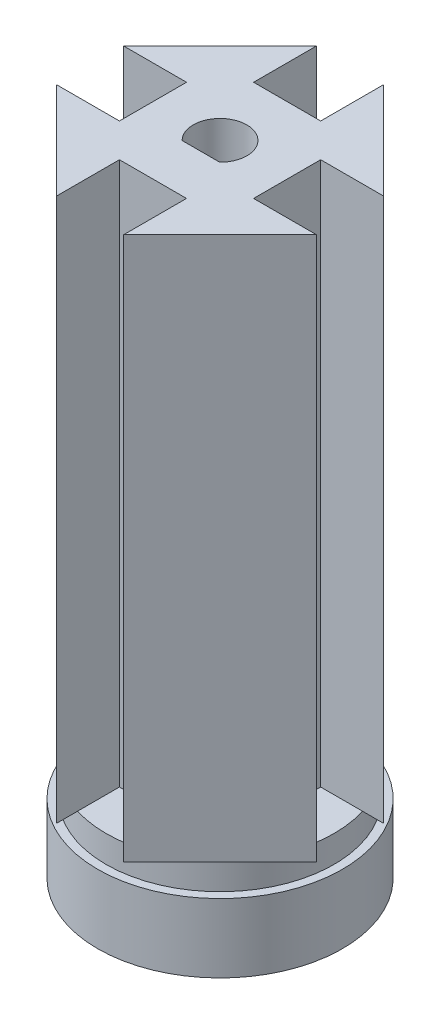
ISO-10303-21;
HEADER;
FILE_DESCRIPTION(('STEP AP214'),'2;1');
FILE_NAME('part.step','',(''),(''),'','','');
FILE_SCHEMA(('AUTOMOTIVE_DESIGN { 1 0 10303 214 1 1 1 1 }'));
ENDSEC;
DATA;
#1=APPLICATION_CONTEXT('core data for automotive mechanical design processes');
#2=APPLICATION_PROTOCOL_DEFINITION('international standard','automotive_design',2000,#1);
#3=PRODUCT_CONTEXT('',#1,'mechanical');
#4=PRODUCT('Part','Part','',(#3));
#5=PRODUCT_RELATED_PRODUCT_CATEGORY('part','',(#4));
#6=PRODUCT_DEFINITION_FORMATION('','',#4);
#7=PRODUCT_DEFINITION_CONTEXT('part definition',#1,'design');
#8=PRODUCT_DEFINITION('design','',#6,#7);
#9=PRODUCT_DEFINITION_SHAPE('','',#8);
#10=(LENGTH_UNIT() NAMED_UNIT(*) SI_UNIT(.MILLI.,.METRE.));
#11=(NAMED_UNIT(*) PLANE_ANGLE_UNIT() SI_UNIT($,.RADIAN.));
#12=(NAMED_UNIT(*) SI_UNIT($,.STERADIAN.) SOLID_ANGLE_UNIT());
#13=UNCERTAINTY_MEASURE_WITH_UNIT(LENGTH_MEASURE(1.E-05),#10,'distance_accuracy_value','');
#14=(GEOMETRIC_REPRESENTATION_CONTEXT(3) GLOBAL_UNCERTAINTY_ASSIGNED_CONTEXT((#13)) GLOBAL_UNIT_ASSIGNED_CONTEXT((#10,
#11,#12)) REPRESENTATION_CONTEXT('',''));
#15=CARTESIAN_POINT('',(0.,0.,0.));
#16=DIRECTION('',(0.,0.,1.));
#17=DIRECTION('',(1.,0.,0.));
#18=AXIS2_PLACEMENT_3D('',#15,#16,#17);
#19=CARTESIAN_POINT('',(0.,4.25499999999989,0.));
#20=DIRECTION('',(0.,1.,0.));
#21=DIRECTION('',(0.,0.,1.));
#22=AXIS2_PLACEMENT_3D('',#19,#20,#21);
#23=PLANE('',#22);
#24=DIRECTION('',(-0.707106781186548,0.,0.707106781186548));
#25=VECTOR('',#24,1.);
#26=CARTESIAN_POINT('',(-12.1824583655185,4.25499999999984,-12.1824583655185));
#27=LINE('',#26,#25);
#28=CARTESIAN_POINT('',(-4.99999999999999,4.25499999999984,-19.3649167310371));
#29=VERTEX_POINT('',#28);
#30=CARTESIAN_POINT('',(-19.3649167310371,4.25499999999988,-5.));
#31=VERTEX_POINT('',#30);
#32=EDGE_CURVE('E398',#29,#31,#27,.T.);
#33=ORIENTED_EDGE('',*,*,#32,.F.);
#34=DIRECTION('',(0.,0.,1.));
#35=VECTOR('',#34,1.);
#36=CARTESIAN_POINT('',(-5.,4.25499999999988,0.));
#37=LINE('',#36,#35);
#38=CARTESIAN_POINT('',(-5.,4.25499999999988,-16.2480768092719));
#39=VERTEX_POINT('',#38);
#40=EDGE_CURVE('E345',#29,#39,#37,.T.);
#41=ORIENTED_EDGE('',*,*,#40,.T.);
#42=CARTESIAN_POINT('',(0.,4.25499999999989,0.));
#43=DIRECTION('',(0.,1.,0.));
#44=DIRECTION('',(0.,0.,1.));
#45=AXIS2_PLACEMENT_3D('',#42,#43,#44);
#46=CIRCLE('',#45,17.);
#47=CARTESIAN_POINT('',(-16.2480768092719,4.25499999999989,-5.));
#48=VERTEX_POINT('',#47);
#49=EDGE_CURVE('E242',#48,#39,#46,.F.);
#50=ORIENTED_EDGE('',*,*,#49,.F.);
#51=DIRECTION('',(-1.,0.,0.));
#52=VECTOR('',#51,1.);
#53=CARTESIAN_POINT('',(0.,4.25499999999988,-5.));
#54=LINE('',#53,#52);
#55=EDGE_CURVE('E316',#48,#31,#54,.T.);
#56=ORIENTED_EDGE('',*,*,#55,.T.);
#57=EDGE_LOOP('',(#33,#41,#50,#56));
#58=FACE_BOUND('',#57,.T.);
#59=ADVANCED_FACE('F51',(#58),#23,.F.);
#60=CARTESIAN_POINT('',(0.,85.2549999999999,0.));
#61=DIRECTION('',(0.,1.,0.));
#62=DIRECTION('',(0.,0.,1.));
#63=AXIS2_PLACEMENT_3D('',#60,#61,#62);
#64=PLANE('',#63);
#65=DIRECTION('',(-0.707106781186548,0.,-0.707106781186548));
#66=VECTOR('',#65,1.);
#67=CARTESIAN_POINT('',(-12.1824583655185,85.2549999999999,12.1824583655185));
#68=LINE('',#67,#66);
#69=CARTESIAN_POINT('',(-5.,85.2549999999999,19.3649167310371));
#70=VERTEX_POINT('',#69);
#71=CARTESIAN_POINT('',(-19.3649167310371,85.2549999999999,5.));
#72=VERTEX_POINT('',#71);
#73=EDGE_CURVE('E448',#70,#72,#68,.T.);
#74=ORIENTED_EDGE('',*,*,#73,.F.);
#75=DIRECTION('',(0.,0.,1.));
#76=VECTOR('',#75,1.);
#77=CARTESIAN_POINT('',(-5.,85.2549999999999,0.));
#78=LINE('',#77,#76);
#79=CARTESIAN_POINT('',(-5.,85.2549999999999,10.));
#80=VERTEX_POINT('',#79);
#81=EDGE_CURVE('E273',#80,#70,#78,.T.);
#82=ORIENTED_EDGE('',*,*,#81,.F.);
#83=DIRECTION('',(1.,0.,0.));
#84=VECTOR('',#83,1.);
#85=CARTESIAN_POINT('',(0.,85.2549999999999,10.));
#86=LINE('',#85,#84);
#87=CARTESIAN_POINT('',(5.,85.2549999999999,10.));
#88=VERTEX_POINT('',#87);
#89=EDGE_CURVE('E279',#80,#88,#86,.T.);
#90=ORIENTED_EDGE('',*,*,#89,.T.);
#91=DIRECTION('',(0.,0.,1.));
#92=VECTOR('',#91,1.);
#93=CARTESIAN_POINT('',(5.,85.2549999999999,0.));
#94=LINE('',#93,#92);
#95=CARTESIAN_POINT('',(5.,85.2549999999999,19.3649167310371));
#96=VERTEX_POINT('',#95);
#97=EDGE_CURVE('E292',#88,#96,#94,.T.);
#98=ORIENTED_EDGE('',*,*,#97,.T.);
#99=DIRECTION('',(-0.707106781186548,0.,0.707106781186548));
#100=VECTOR('',#99,1.);
#101=CARTESIAN_POINT('',(12.1824583655185,85.2549999999999,12.1824583655185));
#102=LINE('',#101,#100);
#103=CARTESIAN_POINT('',(19.3649167310371,85.2549999999999,5.));
#104=VERTEX_POINT('',#103);
#105=EDGE_CURVE('E429',#104,#96,#102,.T.);
#106=ORIENTED_EDGE('',*,*,#105,.F.);
#107=DIRECTION('',(1.,0.,0.));
#108=VECTOR('',#107,1.);
#109=CARTESIAN_POINT('',(0.,85.2549999999999,5.));
#110=LINE('',#109,#108);
#111=CARTESIAN_POINT('',(9.99999673103709,85.2549999999999,5.));
#112=VERTEX_POINT('',#111);
#113=EDGE_CURVE('E402',#112,#104,#110,.T.);
#114=ORIENTED_EDGE('',*,*,#113,.F.);
#115=DIRECTION('',(0.,0.,-1.));
#116=VECTOR('',#115,1.);
#117=CARTESIAN_POINT('',(9.99999673103709,85.2549999999999,0.));
#118=LINE('',#117,#116);
#119=CARTESIAN_POINT('',(9.99999673103709,85.2549999999999,-5.));
#120=VERTEX_POINT('',#119);
#121=EDGE_CURVE('E397',#112,#120,#118,.T.);
#122=ORIENTED_EDGE('',*,*,#121,.T.);
#123=DIRECTION('',(1.,0.,0.));
#124=VECTOR('',#123,1.);
#125=CARTESIAN_POINT('',(0.,85.2549999999999,-5.));
#126=LINE('',#125,#124);
#127=CARTESIAN_POINT('',(19.3649167310371,85.2549999999999,-5.));
#128=VERTEX_POINT('',#127);
#129=EDGE_CURVE('E393',#120,#128,#126,.T.);
#130=ORIENTED_EDGE('',*,*,#129,.T.);
#131=DIRECTION('',(0.707106781186548,0.,0.707106781186548));
#132=VECTOR('',#131,1.);
#133=CARTESIAN_POINT('',(12.1824583655185,85.2549999999999,-12.1824583655185));
#134=LINE('',#133,#132);
#135=CARTESIAN_POINT('',(5.,85.2549999999999,-19.3649167310371));
#136=VERTEX_POINT('',#135);
#137=EDGE_CURVE('E435',#136,#128,#134,.T.);
#138=ORIENTED_EDGE('',*,*,#137,.F.);
#139=DIRECTION('',(0.,0.,1.));
#140=VECTOR('',#139,1.);
#141=CARTESIAN_POINT('',(5.,85.2549999999999,0.));
#142=LINE('',#141,#140);
#143=CARTESIAN_POINT('',(5.,85.2549999999999,-10.));
#144=VERTEX_POINT('',#143);
#145=EDGE_CURVE('E368',#136,#144,#142,.T.);
#146=ORIENTED_EDGE('',*,*,#145,.T.);
#147=DIRECTION('',(1.,0.,0.));
#148=VECTOR('',#147,1.);
#149=CARTESIAN_POINT('',(0.,85.2549999999999,-10.));
#150=LINE('',#149,#148);
#151=CARTESIAN_POINT('',(-5.,85.2549999999999,-10.));
#152=VERTEX_POINT('',#151);
#153=EDGE_CURVE('E363',#152,#144,#150,.T.);
#154=ORIENTED_EDGE('',*,*,#153,.F.);
#155=DIRECTION('',(0.,0.,1.));
#156=VECTOR('',#155,1.);
#157=CARTESIAN_POINT('',(-5.,85.2549999999999,0.));
#158=LINE('',#157,#156);
#159=CARTESIAN_POINT('',(-4.99999999999999,85.2549999999999,-19.3649167310371));
#160=VERTEX_POINT('',#159);
#161=EDGE_CURVE('E359',#160,#152,#158,.T.);
#162=ORIENTED_EDGE('',*,*,#161,.F.);
#163=DIRECTION('',(-0.707106781186548,0.,0.707106781186548));
#164=VECTOR('',#163,1.);
#165=CARTESIAN_POINT('',(-12.1824583655185,85.2549999999999,-12.1824583655185));
#166=LINE('',#165,#164);
#167=CARTESIAN_POINT('',(-19.3649167310371,85.2549999999999,-5.));
#168=VERTEX_POINT('',#167);
#169=EDGE_CURVE('E283',#160,#168,#166,.T.);
#170=ORIENTED_EDGE('',*,*,#169,.T.);
#171=DIRECTION('',(-1.,0.,0.));
#172=VECTOR('',#171,1.);
#173=CARTESIAN_POINT('',(0.,85.2549999999999,-5.));
#174=LINE('',#173,#172);
#175=CARTESIAN_POINT('',(-10.,85.2549999999999,-5.));
#176=VERTEX_POINT('',#175);
#177=EDGE_CURVE('E330',#176,#168,#174,.T.);
#178=ORIENTED_EDGE('',*,*,#177,.F.);
#179=DIRECTION('',(0.,0.,-1.));
#180=VECTOR('',#179,1.);
#181=CARTESIAN_POINT('',(-10.,85.2549999999999,0.));
#182=LINE('',#181,#180);
#183=CARTESIAN_POINT('',(-10.,85.2549999999999,5.));
#184=VERTEX_POINT('',#183);
#185=EDGE_CURVE('E325',#184,#176,#182,.T.);
#186=ORIENTED_EDGE('',*,*,#185,.F.);
#187=DIRECTION('',(-1.,0.,0.));
#188=VECTOR('',#187,1.);
#189=CARTESIAN_POINT('',(0.,85.2549999999999,5.));
#190=LINE('',#189,#188);
#191=EDGE_CURVE('E321',#184,#72,#190,.T.);
#192=ORIENTED_EDGE('',*,*,#191,.T.);
#193=EDGE_LOOP('',(#74,#82,#90,#98,#106,#114,#122,#130,#138,#146,#154,#162,#170,#178,#186,#192));
#194=FACE_BOUND('',#193,.T.);
#195=CARTESIAN_POINT('',(0.,85.2549999999999,0.));
#196=DIRECTION('',(0.,1.,0.));
#197=DIRECTION('',(0.,0.,1.));
#198=AXIS2_PLACEMENT_3D('',#195,#196,#197);
#199=CIRCLE('',#198,4.);
#200=CARTESIAN_POINT('',(2.80668844013724,85.2549999999999,2.85));
#201=VERTEX_POINT('',#200);
#202=CARTESIAN_POINT('',(-2.80668844013724,85.2549999999999,2.85));
#203=VERTEX_POINT('',#202);
#204=EDGE_CURVE('E216',#201,#203,#199,.T.);
#205=ORIENTED_EDGE('',*,*,#204,.F.);
#206=DIRECTION('',(1.,0.,0.));
#207=VECTOR('',#206,1.);
#208=CARTESIAN_POINT('',(0.,85.2549999999999,2.85));
#209=LINE('',#208,#207);
#210=EDGE_CURVE('E205',#203,#201,#209,.T.);
#211=ORIENTED_EDGE('',*,*,#210,.F.);
#212=EDGE_LOOP('',(#205,#211));
#213=FACE_BOUND('',#212,.T.);
#214=ADVANCED_FACE('F215',(#194,#213),#64,.T.);
#215=DIRECTION('',(1.,0.,0.));
#216=VECTOR('',#215,1.);
#217=CARTESIAN_POINT('',(0.,4.25499999999988,5.));
#218=LINE('',#217,#216);
#219=CARTESIAN_POINT('',(16.2480768092719,4.25499999999989,5.));
#220=VERTEX_POINT('',#219);
#221=CARTESIAN_POINT('',(19.3649167310371,4.25499999999984,5.));
#222=VERTEX_POINT('',#221);
#223=EDGE_CURVE('E265',#220,#222,#218,.T.);
#224=ORIENTED_EDGE('',*,*,#223,.T.);
#225=DIRECTION('',(-0.707106781186548,0.,0.707106781186548));
#226=VECTOR('',#225,1.);
#227=CARTESIAN_POINT('',(12.1824583655185,4.25499999999984,12.1824583655185));
#228=LINE('',#227,#226);
#229=CARTESIAN_POINT('',(5.,4.25499999999984,19.3649167310371));
#230=VERTEX_POINT('',#229);
#231=EDGE_CURVE('E268',#222,#230,#228,.T.);
#232=ORIENTED_EDGE('',*,*,#231,.T.);
#233=DIRECTION('',(0.,0.,1.));
#234=VECTOR('',#233,1.);
#235=CARTESIAN_POINT('',(5.,4.25499999999988,0.));
#236=LINE('',#235,#234);
#237=CARTESIAN_POINT('',(5.,4.25499999999988,16.2480768092719));
#238=VERTEX_POINT('',#237);
#239=EDGE_CURVE('E267',#238,#230,#236,.T.);
#240=ORIENTED_EDGE('',*,*,#239,.F.);
#241=EDGE_CURVE('E226',#220,#238,#46,.F.);
#242=ORIENTED_EDGE('',*,*,#241,.F.);
#243=EDGE_LOOP('',(#224,#232,#240,#242));
#244=FACE_BOUND('',#243,.T.);
#245=ADVANCED_FACE('F263',(#244),#23,.F.);
#246=DIRECTION('',(0.,0.,1.));
#247=VECTOR('',#246,1.);
#248=CARTESIAN_POINT('',(-5.,4.25499999999988,0.));
#249=LINE('',#248,#247);
#250=CARTESIAN_POINT('',(-5.,4.25499999999989,16.2480768092719));
#251=VERTEX_POINT('',#250);
#252=CARTESIAN_POINT('',(-5.,4.25499999999988,19.3649167310371));
#253=VERTEX_POINT('',#252);
#254=EDGE_CURVE('E287',#251,#253,#249,.T.);
#255=ORIENTED_EDGE('',*,*,#254,.T.);
#256=DIRECTION('',(-0.707106781186548,0.,-0.707106781186548));
#257=VECTOR('',#256,1.);
#258=CARTESIAN_POINT('',(-12.1824583655185,4.25499999999984,12.1824583655185));
#259=LINE('',#258,#257);
#260=CARTESIAN_POINT('',(-19.3649167310371,4.25499999999984,5.));
#261=VERTEX_POINT('',#260);
#262=EDGE_CURVE('E441',#253,#261,#259,.T.);
#263=ORIENTED_EDGE('',*,*,#262,.T.);
#264=DIRECTION('',(-1.,0.,0.));
#265=VECTOR('',#264,1.);
#266=CARTESIAN_POINT('',(0.,4.25499999999988,5.));
#267=LINE('',#266,#265);
#268=CARTESIAN_POINT('',(-16.2480768092719,4.25499999999988,5.));
#269=VERTEX_POINT('',#268);
#270=EDGE_CURVE('E312',#269,#261,#267,.T.);
#271=ORIENTED_EDGE('',*,*,#270,.F.);
#272=EDGE_CURVE('E55',#251,#269,#46,.F.);
#273=ORIENTED_EDGE('',*,*,#272,.F.);
#274=EDGE_LOOP('',(#255,#263,#271,#273));
#275=FACE_BOUND('',#274,.T.);
#276=ADVANCED_FACE('F488',(#275),#23,.F.);
#277=DIRECTION('',(0.,0.,1.));
#278=VECTOR('',#277,1.);
#279=CARTESIAN_POINT('',(5.,4.25499999999988,0.));
#280=LINE('',#279,#278);
#281=CARTESIAN_POINT('',(5.,4.25499999999988,-19.3649167310371));
#282=VERTEX_POINT('',#281);
#283=CARTESIAN_POINT('',(5.,4.25499999999989,-16.2480768092719));
#284=VERTEX_POINT('',#283);
#285=EDGE_CURVE('E355',#282,#284,#280,.T.);
#286=ORIENTED_EDGE('',*,*,#285,.F.);
#287=DIRECTION('',(0.707106781186548,0.,0.707106781186548));
#288=VECTOR('',#287,1.);
#289=CARTESIAN_POINT('',(12.1824583655185,4.25499999999984,-12.1824583655185));
#290=LINE('',#289,#288);
#291=CARTESIAN_POINT('',(19.3649167310371,4.25499999999984,-5.));
#292=VERTEX_POINT('',#291);
#293=EDGE_CURVE('E439',#282,#292,#290,.T.);
#294=ORIENTED_EDGE('',*,*,#293,.T.);
#295=DIRECTION('',(1.,0.,0.));
#296=VECTOR('',#295,1.);
#297=CARTESIAN_POINT('',(0.,4.25499999999988,-5.));
#298=LINE('',#297,#296);
#299=CARTESIAN_POINT('',(16.2480768092719,4.25499999999988,-5.));
#300=VERTEX_POINT('',#299);
#301=EDGE_CURVE('E388',#300,#292,#298,.T.);
#302=ORIENTED_EDGE('',*,*,#301,.F.);
#303=EDGE_CURVE('E249',#284,#300,#46,.F.);
#304=ORIENTED_EDGE('',*,*,#303,.F.);
#305=EDGE_LOOP('',(#286,#294,#302,#304));
#306=FACE_BOUND('',#305,.T.);
#307=ADVANCED_FACE('F467',(#306),#23,.F.);
#308=CARTESIAN_POINT('',(0.,5.25499999999989,0.));
#309=DIRECTION('',(0.,-1.,0.));
#310=DIRECTION('',(0.,0.,-1.));
#311=AXIS2_PLACEMENT_3D('',#308,#309,#310);
#312=CYLINDRICAL_SURFACE('',#311,4.);
#313=DIRECTION('',(0.,-1.,0.));
#314=VECTOR('',#313,1.);
#315=CARTESIAN_POINT('',(2.80668844013724,85.2549999999999,2.85));
#316=LINE('',#315,#314);
#317=CARTESIAN_POINT('',(2.80668844013724,0.254999999999901,2.85));
#318=VERTEX_POINT('',#317);
#319=EDGE_CURVE('E211',#201,#318,#316,.T.);
#320=ORIENTED_EDGE('',*,*,#319,.F.);
#321=ORIENTED_EDGE('',*,*,#204,.T.);
#322=DIRECTION('',(0.,-1.,0.));
#323=VECTOR('',#322,1.);
#324=CARTESIAN_POINT('',(-2.80668844013724,85.2549999999999,2.85));
#325=LINE('',#324,#323);
#326=CARTESIAN_POINT('',(-2.80668844013724,0.254999999999901,2.85));
#327=VERTEX_POINT('',#326);
#328=EDGE_CURVE('E202',#203,#327,#325,.T.);
#329=ORIENTED_EDGE('',*,*,#328,.T.);
#330=CARTESIAN_POINT('',(0.,0.254999999999901,0.));
#331=DIRECTION('',(0.,1.,0.));
#332=DIRECTION('',(0.,0.,1.));
#333=AXIS2_PLACEMENT_3D('',#330,#331,#332);
#334=CIRCLE('',#333,4.);
#335=EDGE_CURVE('E61',#318,#327,#334,.T.);
#336=ORIENTED_EDGE('',*,*,#335,.F.);
#337=EDGE_LOOP('',(#320,#321,#329,#336));
#338=FACE_BOUND('',#337,.T.);
#339=ADVANCED_FACE('F53',(#338),#312,.F.);
#340=CARTESIAN_POINT('',(0.,5.25499999999989,0.));
#341=DIRECTION('',(0.,-1.,0.));
#342=DIRECTION('',(0.,0.,-1.));
#343=AXIS2_PLACEMENT_3D('',#340,#341,#342);
#344=CYLINDRICAL_SURFACE('',#343,17.);
#345=CARTESIAN_POINT('',(0.,0.254999999999901,0.));
#346=DIRECTION('',(0.,1.,0.));
#347=DIRECTION('',(0.,0.,1.));
#348=AXIS2_PLACEMENT_3D('',#345,#346,#347);
#349=CIRCLE('',#348,17.);
#350=CARTESIAN_POINT('',(0.,0.254999999999901,17.));
#351=VERTEX_POINT('',#350);
#352=EDGE_CURVE('E12',#351,#351,#349,.F.);
#353=ORIENTED_EDGE('',*,*,#352,.F.);
#354=EDGE_LOOP('',(#353));
#355=FACE_BOUND('',#354,.T.);
#356=ORIENTED_EDGE('',*,*,#272,.T.);
#357=EDGE_CURVE('E237',#269,#48,#46,.F.);
#358=ORIENTED_EDGE('',*,*,#357,.T.);
#359=ORIENTED_EDGE('',*,*,#49,.T.);
#360=EDGE_CURVE('E245',#39,#284,#46,.F.);
#361=ORIENTED_EDGE('',*,*,#360,.T.);
#362=ORIENTED_EDGE('',*,*,#303,.T.);
#363=EDGE_CURVE('E252',#300,#220,#46,.F.);
#364=ORIENTED_EDGE('',*,*,#363,.T.);
#365=ORIENTED_EDGE('',*,*,#241,.T.);
#366=EDGE_CURVE('E220',#238,#251,#46,.F.);
#367=ORIENTED_EDGE('',*,*,#366,.T.);
#368=EDGE_LOOP('',(#356,#358,#359,#361,#362,#364,#365,#367));
#369=FACE_BOUND('',#368,.T.);
#370=ADVANCED_FACE('F259',(#355,#369),#344,.T.);
#371=CARTESIAN_POINT('',(0.,0.254999999999901,0.));
#372=DIRECTION('',(0.,1.,0.));
#373=DIRECTION('',(0.,0.,1.));
#374=AXIS2_PLACEMENT_3D('',#371,#372,#373);
#375=PLANE('',#374);
#376=ORIENTED_EDGE('',*,*,#335,.T.);
#377=DIRECTION('',(1.,0.,0.));
#378=VECTOR('',#377,1.);
#379=CARTESIAN_POINT('',(0.,0.254999999999901,2.85));
#380=LINE('',#379,#378);
#381=EDGE_CURVE('E67',#327,#318,#380,.T.);
#382=ORIENTED_EDGE('',*,*,#381,.T.);
#383=EDGE_LOOP('',(#376,#382));
#384=FACE_BOUND('',#383,.T.);
#385=ORIENTED_EDGE('',*,*,#352,.T.);
#386=EDGE_LOOP('',(#385));
#387=FACE_BOUND('',#386,.T.);
#388=ADVANCED_FACE('F506',(#384,#387),#375,.F.);
#389=CARTESIAN_POINT('',(0.,4.25499999999988,-5.));
#390=DIRECTION('',(0.,0.,1.));
#391=DIRECTION('',(1.,0.,0.));
#392=AXIS2_PLACEMENT_3D('',#389,#390,#391);
#393=PLANE('',#392);
#394=ORIENTED_EDGE('',*,*,#129,.F.);
#395=DIRECTION('',(0.,1.,0.));
#396=VECTOR('',#395,1.);
#397=CARTESIAN_POINT('',(9.99999673103709,4.25499999999988,-5.));
#398=LINE('',#397,#396);
#399=CARTESIAN_POINT('',(9.99999673103709,4.25499999999988,-5.));
#400=VERTEX_POINT('',#399);
#401=EDGE_CURVE('E232',#400,#120,#398,.T.);
#402=ORIENTED_EDGE('',*,*,#401,.F.);
#403=EDGE_CURVE('E383',#400,#300,#298,.T.);
#404=ORIENTED_EDGE('',*,*,#403,.T.);
#405=ORIENTED_EDGE('',*,*,#301,.T.);
#406=DIRECTION('',(0.,1.,0.));
#407=VECTOR('',#406,1.);
#408=CARTESIAN_POINT('',(19.3649167310371,4.25499999999988,-5.));
#409=LINE('',#408,#407);
#410=EDGE_CURVE('E364',#292,#128,#409,.T.);
#411=ORIENTED_EDGE('',*,*,#410,.T.);
#412=EDGE_LOOP('',(#394,#402,#404,#405,#411));
#413=FACE_BOUND('',#412,.T.);
#414=ADVANCED_FACE('F423',(#413),#393,.T.);
#415=CARTESIAN_POINT('',(0.,4.25499999999988,5.));
#416=DIRECTION('',(0.,0.,1.));
#417=DIRECTION('',(1.,0.,0.));
#418=AXIS2_PLACEMENT_3D('',#415,#416,#417);
#419=PLANE('',#418);
#420=ORIENTED_EDGE('',*,*,#113,.T.);
#421=DIRECTION('',(0.,1.,0.));
#422=VECTOR('',#421,1.);
#423=CARTESIAN_POINT('',(19.3649167310371,4.25499999999988,5.));
#424=LINE('',#423,#422);
#425=EDGE_CURVE('E409',#222,#104,#424,.T.);
#426=ORIENTED_EDGE('',*,*,#425,.F.);
#427=ORIENTED_EDGE('',*,*,#223,.F.);
#428=CARTESIAN_POINT('',(9.99999673103709,4.25499999999988,5.));
#429=VERTEX_POINT('',#428);
#430=EDGE_CURVE('E75',#429,#220,#218,.T.);
#431=ORIENTED_EDGE('',*,*,#430,.F.);
#432=DIRECTION('',(0.,1.,0.));
#433=VECTOR('',#432,1.);
#434=CARTESIAN_POINT('',(9.99999673103709,4.25499999999988,5.));
#435=LINE('',#434,#433);
#436=EDGE_CURVE('E411',#429,#112,#435,.T.);
#437=ORIENTED_EDGE('',*,*,#436,.T.);
#438=EDGE_LOOP('',(#420,#426,#427,#431,#437));
#439=FACE_BOUND('',#438,.T.);
#440=ADVANCED_FACE('F431',(#439),#419,.F.);
#441=CARTESIAN_POINT('',(9.99999673103709,4.25499999999988,0.));
#442=DIRECTION('',(1.,0.,0.));
#443=DIRECTION('',(0.,0.,-1.));
#444=AXIS2_PLACEMENT_3D('',#441,#442,#443);
#445=PLANE('',#444);
#446=ORIENTED_EDGE('',*,*,#121,.F.);
#447=ORIENTED_EDGE('',*,*,#436,.F.);
#448=DIRECTION('',(0.,0.,-1.));
#449=VECTOR('',#448,1.);
#450=CARTESIAN_POINT('',(9.99999673103709,4.25499999999988,0.));
#451=LINE('',#450,#449);
#452=EDGE_CURVE('E387',#429,#400,#451,.T.);
#453=ORIENTED_EDGE('',*,*,#452,.T.);
#454=ORIENTED_EDGE('',*,*,#401,.T.);
#455=EDGE_LOOP('',(#446,#447,#453,#454));
#456=FACE_BOUND('',#455,.T.);
#457=ADVANCED_FACE('F419',(#456),#445,.T.);
#458=CARTESIAN_POINT('',(0.,4.25499999999988,0.));
#459=DIRECTION('',(0.,1.,0.));
#460=DIRECTION('',(0.,0.,1.));
#461=AXIS2_PLACEMENT_3D('',#458,#459,#460);
#462=PLANE('',#461);
#463=ORIENTED_EDGE('',*,*,#403,.F.);
#464=ORIENTED_EDGE('',*,*,#452,.F.);
#465=ORIENTED_EDGE('',*,*,#430,.T.);
#466=ORIENTED_EDGE('',*,*,#363,.F.);
#467=EDGE_LOOP('',(#463,#464,#465,#466));
#468=FACE_BOUND('',#467,.T.);
#469=ADVANCED_FACE('F472',(#468),#462,.T.);
#470=CARTESIAN_POINT('',(-5.,4.25499999999988,0.));
#471=DIRECTION('',(-1.,0.,0.));
#472=DIRECTION('',(0.,0.,1.));
#473=AXIS2_PLACEMENT_3D('',#470,#471,#472);
#474=PLANE('',#473);
#475=ORIENTED_EDGE('',*,*,#161,.T.);
#476=DIRECTION('',(0.,1.,0.));
#477=VECTOR('',#476,1.);
#478=CARTESIAN_POINT('',(-5.,4.25499999999988,-10.));
#479=LINE('',#478,#477);
#480=CARTESIAN_POINT('',(-5.,4.25499999999988,-10.));
#481=VERTEX_POINT('',#480);
#482=EDGE_CURVE('E358',#481,#152,#479,.T.);
#483=ORIENTED_EDGE('',*,*,#482,.F.);
#484=EDGE_CURVE('E350',#39,#481,#37,.T.);
#485=ORIENTED_EDGE('',*,*,#484,.F.);
#486=ORIENTED_EDGE('',*,*,#40,.F.);
#487=DIRECTION('',(0.,1.,0.));
#488=VECTOR('',#487,1.);
#489=CARTESIAN_POINT('',(-5.,4.25499999999988,-19.3649167310371));
#490=LINE('',#489,#488);
#491=EDGE_CURVE('E326',#29,#160,#490,.T.);
#492=ORIENTED_EDGE('',*,*,#491,.T.);
#493=EDGE_LOOP('',(#475,#483,#485,#486,#492));
#494=FACE_BOUND('',#493,.T.);
#495=ADVANCED_FACE('F474',(#494),#474,.F.);
#496=CARTESIAN_POINT('',(5.,4.25499999999988,0.));
#497=DIRECTION('',(-1.,0.,0.));
#498=DIRECTION('',(0.,0.,1.));
#499=AXIS2_PLACEMENT_3D('',#496,#497,#498);
#500=PLANE('',#499);
#501=ORIENTED_EDGE('',*,*,#145,.F.);
#502=DIRECTION('',(0.,1.,0.));
#503=VECTOR('',#502,1.);
#504=CARTESIAN_POINT('',(5.,4.25499999999988,-19.3649167310371));
#505=LINE('',#504,#503);
#506=EDGE_CURVE('E375',#282,#136,#505,.T.);
#507=ORIENTED_EDGE('',*,*,#506,.F.);
#508=ORIENTED_EDGE('',*,*,#285,.T.);
#509=CARTESIAN_POINT('',(5.,4.25499999999988,-10.));
#510=VERTEX_POINT('',#509);
#511=EDGE_CURVE('E354',#284,#510,#280,.T.);
#512=ORIENTED_EDGE('',*,*,#511,.T.);
#513=DIRECTION('',(0.,1.,0.));
#514=VECTOR('',#513,1.);
#515=CARTESIAN_POINT('',(5.,4.25499999999988,-10.));
#516=LINE('',#515,#514);
#517=EDGE_CURVE('E378',#510,#144,#516,.T.);
#518=ORIENTED_EDGE('',*,*,#517,.T.);
#519=EDGE_LOOP('',(#501,#507,#508,#512,#518));
#520=FACE_BOUND('',#519,.T.);
#521=ADVANCED_FACE('F480',(#520),#500,.T.);
#522=CARTESIAN_POINT('',(0.,4.25499999999988,-10.));
#523=DIRECTION('',(0.,0.,1.));
#524=DIRECTION('',(1.,0.,0.));
#525=AXIS2_PLACEMENT_3D('',#522,#523,#524);
#526=PLANE('',#525);
#527=ORIENTED_EDGE('',*,*,#153,.T.);
#528=ORIENTED_EDGE('',*,*,#517,.F.);
#529=DIRECTION('',(1.,0.,0.));
#530=VECTOR('',#529,1.);
#531=CARTESIAN_POINT('',(0.,4.25499999999988,-10.));
#532=LINE('',#531,#530);
#533=EDGE_CURVE('E349',#481,#510,#532,.T.);
#534=ORIENTED_EDGE('',*,*,#533,.F.);
#535=ORIENTED_EDGE('',*,*,#482,.T.);
#536=EDGE_LOOP('',(#527,#528,#534,#535));
#537=FACE_BOUND('',#536,.T.);
#538=ADVANCED_FACE('F539',(#537),#526,.F.);
#539=CARTESIAN_POINT('',(0.,4.25499999999988,0.));
#540=DIRECTION('',(0.,1.,0.));
#541=DIRECTION('',(0.,0.,1.));
#542=AXIS2_PLACEMENT_3D('',#539,#540,#541);
#543=PLANE('',#542);
#544=ORIENTED_EDGE('',*,*,#484,.T.);
#545=ORIENTED_EDGE('',*,*,#533,.T.);
#546=ORIENTED_EDGE('',*,*,#511,.F.);
#547=ORIENTED_EDGE('',*,*,#360,.F.);
#548=EDGE_LOOP('',(#544,#545,#546,#547));
#549=FACE_BOUND('',#548,.T.);
#550=ADVANCED_FACE('F544',(#549),#543,.T.);
#551=CARTESIAN_POINT('',(0.,4.25499999999988,5.));
#552=DIRECTION('',(0.,0.,-1.));
#553=DIRECTION('',(-1.,0.,0.));
#554=AXIS2_PLACEMENT_3D('',#551,#552,#553);
#555=PLANE('',#554);
#556=ORIENTED_EDGE('',*,*,#191,.F.);
#557=DIRECTION('',(0.,1.,0.));
#558=VECTOR('',#557,1.);
#559=CARTESIAN_POINT('',(-10.,4.25499999999988,5.));
#560=LINE('',#559,#558);
#561=CARTESIAN_POINT('',(-10.,4.25499999999988,5.));
#562=VERTEX_POINT('',#561);
#563=EDGE_CURVE('E320',#562,#184,#560,.T.);
#564=ORIENTED_EDGE('',*,*,#563,.F.);
#565=EDGE_CURVE('E307',#562,#269,#267,.T.);
#566=ORIENTED_EDGE('',*,*,#565,.T.);
#567=ORIENTED_EDGE('',*,*,#270,.T.);
#568=DIRECTION('',(0.,1.,0.));
#569=VECTOR('',#568,1.);
#570=CARTESIAN_POINT('',(-19.3649167310371,4.25499999999988,5.));
#571=LINE('',#570,#569);
#572=EDGE_CURVE('E296',#261,#72,#571,.T.);
#573=ORIENTED_EDGE('',*,*,#572,.T.);
#574=EDGE_LOOP('',(#556,#564,#566,#567,#573));
#575=FACE_BOUND('',#574,.T.);
#576=ADVANCED_FACE('F556',(#575),#555,.T.);
#577=CARTESIAN_POINT('',(0.,4.25499999999988,-5.));
#578=DIRECTION('',(0.,0.,-1.));
#579=DIRECTION('',(-1.,0.,0.));
#580=AXIS2_PLACEMENT_3D('',#577,#578,#579);
#581=PLANE('',#580);
#582=ORIENTED_EDGE('',*,*,#177,.T.);
#583=DIRECTION('',(0.,1.,0.));
#584=VECTOR('',#583,1.);
#585=CARTESIAN_POINT('',(-19.3649167310371,4.25499999999988,-5.));
#586=LINE('',#585,#584);
#587=EDGE_CURVE('E337',#31,#168,#586,.T.);
#588=ORIENTED_EDGE('',*,*,#587,.F.);
#589=ORIENTED_EDGE('',*,*,#55,.F.);
#590=CARTESIAN_POINT('',(-10.,4.25499999999988,-5.));
#591=VERTEX_POINT('',#590);
#592=EDGE_CURVE('E317',#591,#48,#54,.T.);
#593=ORIENTED_EDGE('',*,*,#592,.F.);
#594=DIRECTION('',(0.,1.,0.));
#595=VECTOR('',#594,1.);
#596=CARTESIAN_POINT('',(-10.,4.25499999999988,-5.));
#597=LINE('',#596,#595);
#598=EDGE_CURVE('E340',#591,#176,#597,.T.);
#599=ORIENTED_EDGE('',*,*,#598,.T.);
#600=EDGE_LOOP('',(#582,#588,#589,#593,#599));
#601=FACE_BOUND('',#600,.T.);
#602=ADVANCED_FACE('F570',(#601),#581,.F.);
#603=CARTESIAN_POINT('',(-10.,4.25499999999988,0.));
#604=DIRECTION('',(1.,0.,0.));
#605=DIRECTION('',(0.,0.,-1.));
#606=AXIS2_PLACEMENT_3D('',#603,#604,#605);
#607=PLANE('',#606);
#608=ORIENTED_EDGE('',*,*,#185,.T.);
#609=ORIENTED_EDGE('',*,*,#598,.F.);
#610=DIRECTION('',(0.,0.,-1.));
#611=VECTOR('',#610,1.);
#612=CARTESIAN_POINT('',(-10.,4.25499999999988,0.));
#613=LINE('',#612,#611);
#614=EDGE_CURVE('E311',#562,#591,#613,.T.);
#615=ORIENTED_EDGE('',*,*,#614,.F.);
#616=ORIENTED_EDGE('',*,*,#563,.T.);
#617=EDGE_LOOP('',(#608,#609,#615,#616));
#618=FACE_BOUND('',#617,.T.);
#619=ADVANCED_FACE('F564',(#618),#607,.F.);
#620=CARTESIAN_POINT('',(0.,4.25499999999988,0.));
#621=DIRECTION('',(0.,1.,0.));
#622=DIRECTION('',(0.,0.,1.));
#623=AXIS2_PLACEMENT_3D('',#620,#621,#622);
#624=PLANE('',#623);
#625=ORIENTED_EDGE('',*,*,#565,.F.);
#626=ORIENTED_EDGE('',*,*,#614,.T.);
#627=ORIENTED_EDGE('',*,*,#592,.T.);
#628=ORIENTED_EDGE('',*,*,#357,.F.);
#629=EDGE_LOOP('',(#625,#626,#627,#628));
#630=FACE_BOUND('',#629,.T.);
#631=ADVANCED_FACE('F569',(#630),#624,.T.);
#632=CARTESIAN_POINT('',(5.,4.25499999999988,0.));
#633=DIRECTION('',(-1.,0.,0.));
#634=DIRECTION('',(0.,0.,1.));
#635=AXIS2_PLACEMENT_3D('',#632,#633,#634);
#636=PLANE('',#635);
#637=ORIENTED_EDGE('',*,*,#97,.F.);
#638=DIRECTION('',(0.,1.,0.));
#639=VECTOR('',#638,1.);
#640=CARTESIAN_POINT('',(5.,4.25499999999988,10.));
#641=LINE('',#640,#639);
#642=CARTESIAN_POINT('',(5.,4.25499999999988,10.));
#643=VERTEX_POINT('',#642);
#644=EDGE_CURVE('E291',#643,#88,#641,.T.);
#645=ORIENTED_EDGE('',*,*,#644,.F.);
#646=EDGE_CURVE('E272',#643,#238,#236,.T.);
#647=ORIENTED_EDGE('',*,*,#646,.T.);
#648=ORIENTED_EDGE('',*,*,#239,.T.);
#649=DIRECTION('',(0.,1.,0.));
#650=VECTOR('',#649,1.);
#651=CARTESIAN_POINT('',(5.,4.25499999999988,19.3649167310371));
#652=LINE('',#651,#650);
#653=EDGE_CURVE('E221',#230,#96,#652,.T.);
#654=ORIENTED_EDGE('',*,*,#653,.T.);
#655=EDGE_LOOP('',(#637,#645,#647,#648,#654));
#656=FACE_BOUND('',#655,.T.);
#657=ADVANCED_FACE('F582',(#656),#636,.T.);
#658=CARTESIAN_POINT('',(-5.,4.25499999999988,0.));
#659=DIRECTION('',(-1.,0.,0.));
#660=DIRECTION('',(0.,0.,1.));
#661=AXIS2_PLACEMENT_3D('',#658,#659,#660);
#662=PLANE('',#661);
#663=ORIENTED_EDGE('',*,*,#81,.T.);
#664=DIRECTION('',(0.,1.,0.));
#665=VECTOR('',#664,1.);
#666=CARTESIAN_POINT('',(-5.,4.25499999999988,19.3649167310371));
#667=LINE('',#666,#665);
#668=EDGE_CURVE('E228',#253,#70,#667,.T.);
#669=ORIENTED_EDGE('',*,*,#668,.F.);
#670=ORIENTED_EDGE('',*,*,#254,.F.);
#671=CARTESIAN_POINT('',(-5.,4.25499999999988,10.));
#672=VERTEX_POINT('',#671);
#673=EDGE_CURVE('E288',#672,#251,#249,.T.);
#674=ORIENTED_EDGE('',*,*,#673,.F.);
#675=DIRECTION('',(0.,1.,0.));
#676=VECTOR('',#675,1.);
#677=CARTESIAN_POINT('',(-5.,4.25499999999988,10.));
#678=LINE('',#677,#676);
#679=EDGE_CURVE('E302',#672,#80,#678,.T.);
#680=ORIENTED_EDGE('',*,*,#679,.T.);
#681=EDGE_LOOP('',(#663,#669,#670,#674,#680));
#682=FACE_BOUND('',#681,.T.);
#683=ADVANCED_FACE('F596',(#682),#662,.F.);
#684=CARTESIAN_POINT('',(0.,4.25499999999988,10.));
#685=DIRECTION('',(0.,0.,1.));
#686=DIRECTION('',(1.,0.,0.));
#687=AXIS2_PLACEMENT_3D('',#684,#685,#686);
#688=PLANE('',#687);
#689=ORIENTED_EDGE('',*,*,#89,.F.);
#690=ORIENTED_EDGE('',*,*,#679,.F.);
#691=DIRECTION('',(1.,0.,0.));
#692=VECTOR('',#691,1.);
#693=CARTESIAN_POINT('',(0.,4.25499999999988,10.));
#694=LINE('',#693,#692);
#695=EDGE_CURVE('E277',#672,#643,#694,.T.);
#696=ORIENTED_EDGE('',*,*,#695,.T.);
#697=ORIENTED_EDGE('',*,*,#644,.T.);
#698=EDGE_LOOP('',(#689,#690,#696,#697));
#699=FACE_BOUND('',#698,.T.);
#700=ADVANCED_FACE('F590',(#699),#688,.T.);
#701=CARTESIAN_POINT('',(0.,4.25499999999988,0.));
#702=DIRECTION('',(0.,1.,0.));
#703=DIRECTION('',(0.,0.,1.));
#704=AXIS2_PLACEMENT_3D('',#701,#702,#703);
#705=PLANE('',#704);
#706=ORIENTED_EDGE('',*,*,#646,.F.);
#707=ORIENTED_EDGE('',*,*,#695,.F.);
#708=ORIENTED_EDGE('',*,*,#673,.T.);
#709=ORIENTED_EDGE('',*,*,#366,.F.);
#710=EDGE_LOOP('',(#706,#707,#708,#709));
#711=FACE_BOUND('',#710,.T.);
#712=ADVANCED_FACE('F595',(#711),#705,.T.);
#713=CARTESIAN_POINT('',(-12.1824583655185,4.25499999999984,12.1824583655185));
#714=DIRECTION('',(0.707106781186547,0.,-0.707106781186547));
#715=DIRECTION('',(-0.707106781186548,0.,-0.707106781186548));
#716=AXIS2_PLACEMENT_3D('',#713,#714,#715);
#717=PLANE('',#716);
#718=ORIENTED_EDGE('',*,*,#73,.T.);
#719=ORIENTED_EDGE('',*,*,#572,.F.);
#720=ORIENTED_EDGE('',*,*,#262,.F.);
#721=ORIENTED_EDGE('',*,*,#668,.T.);
#722=EDGE_LOOP('',(#718,#719,#720,#721));
#723=FACE_BOUND('',#722,.T.);
#724=ADVANCED_FACE('F607',(#723),#717,.F.);
#725=CARTESIAN_POINT('',(12.1824583655185,4.25499999999984,12.1824583655185));
#726=DIRECTION('',(-0.707106781186547,0.,-0.707106781186547));
#727=DIRECTION('',(-0.707106781186548,0.,0.707106781186548));
#728=AXIS2_PLACEMENT_3D('',#725,#726,#727);
#729=PLANE('',#728);
#730=ORIENTED_EDGE('',*,*,#105,.T.);
#731=ORIENTED_EDGE('',*,*,#653,.F.);
#732=ORIENTED_EDGE('',*,*,#231,.F.);
#733=ORIENTED_EDGE('',*,*,#425,.T.);
#734=EDGE_LOOP('',(#730,#731,#732,#733));
#735=FACE_BOUND('',#734,.T.);
#736=ADVANCED_FACE('F433',(#735),#729,.F.);
#737=CARTESIAN_POINT('',(-12.1824583655185,4.25499999999984,-12.1824583655185));
#738=DIRECTION('',(-0.707106781186547,0.,-0.707106781186547));
#739=DIRECTION('',(-0.707106781186548,0.,0.707106781186548));
#740=AXIS2_PLACEMENT_3D('',#737,#738,#739);
#741=PLANE('',#740);
#742=ORIENTED_EDGE('',*,*,#169,.F.);
#743=ORIENTED_EDGE('',*,*,#491,.F.);
#744=ORIENTED_EDGE('',*,*,#32,.T.);
#745=ORIENTED_EDGE('',*,*,#587,.T.);
#746=EDGE_LOOP('',(#742,#743,#744,#745));
#747=FACE_BOUND('',#746,.T.);
#748=ADVANCED_FACE('F668',(#747),#741,.T.);
#749=CARTESIAN_POINT('',(12.1824583655185,4.25499999999984,-12.1824583655185));
#750=DIRECTION('',(-0.707106781186547,0.,0.707106781186547));
#751=DIRECTION('',(0.707106781186548,0.,0.707106781186548));
#752=AXIS2_PLACEMENT_3D('',#749,#750,#751);
#753=PLANE('',#752);
#754=ORIENTED_EDGE('',*,*,#137,.T.);
#755=ORIENTED_EDGE('',*,*,#410,.F.);
#756=ORIENTED_EDGE('',*,*,#293,.F.);
#757=ORIENTED_EDGE('',*,*,#506,.T.);
#758=EDGE_LOOP('',(#754,#755,#756,#757));
#759=FACE_BOUND('',#758,.T.);
#760=ADVANCED_FACE('F660',(#759),#753,.F.);
#761=CARTESIAN_POINT('',(0.,85.2549999999999,2.85));
#762=DIRECTION('',(0.,0.,-1.));
#763=DIRECTION('',(-1.,0.,0.));
#764=AXIS2_PLACEMENT_3D('',#761,#762,#763);
#765=PLANE('',#764);
#766=ORIENTED_EDGE('',*,*,#381,.F.);
#767=ORIENTED_EDGE('',*,*,#328,.F.);
#768=ORIENTED_EDGE('',*,*,#210,.T.);
#769=ORIENTED_EDGE('',*,*,#319,.T.);
#770=EDGE_LOOP('',(#766,#767,#768,#769));
#771=FACE_BOUND('',#770,.T.);
#772=ADVANCED_FACE('F204',(#771),#765,.T.);
#773=CLOSED_SHELL('',(#59,#214,#245,#276,#307,#339,#370,#388,#414,#440,#457,#469,#495,#521,#538,
#550,#576,#602,#619,#631,#657,#683,#700,#712,#724,#736,#748,#760,#772));
#774=MANIFOLD_SOLID_BREP('B2',#773);
#775=CARTESIAN_POINT('',(0.,-10.,0.));
#776=DIRECTION('',(0.,1.,0.));
#777=DIRECTION('',(0.,0.,1.));
#778=AXIS2_PLACEMENT_3D('',#775,#776,#777);
#779=CYLINDRICAL_SURFACE('',#778,18.25);
#780=CARTESIAN_POINT('',(0.,-10.,0.));
#781=DIRECTION('',(0.,1.,0.));
#782=DIRECTION('',(0.,0.,1.));
#783=AXIS2_PLACEMENT_3D('',#780,#781,#782);
#784=CIRCLE('',#783,18.25);
#785=CARTESIAN_POINT('',(0.,-10.,18.25));
#786=VERTEX_POINT('',#785);
#787=EDGE_CURVE('E50',#786,#786,#784,.T.);
#788=ORIENTED_EDGE('',*,*,#787,.T.);
#789=EDGE_LOOP('',(#788));
#790=FACE_BOUND('',#789,.T.);
#791=CARTESIAN_POINT('',(0.,0.254999999999901,0.));
#792=DIRECTION('',(0.,1.,0.));
#793=DIRECTION('',(0.,0.,1.));
#794=AXIS2_PLACEMENT_3D('',#791,#792,#793);
#795=CIRCLE('',#794,18.25);
#796=CARTESIAN_POINT('',(0.,0.254999999999901,18.25));
#797=VERTEX_POINT('',#796);
#798=EDGE_CURVE('E816',#797,#797,#795,.T.);
#799=ORIENTED_EDGE('',*,*,#798,.F.);
#800=EDGE_LOOP('',(#799));
#801=FACE_BOUND('',#800,.T.);
#802=ADVANCED_FACE('F806',(#790,#801),#779,.T.);
#803=CARTESIAN_POINT('',(0.,-10.,0.));
#804=DIRECTION('',(0.,1.,0.));
#805=DIRECTION('',(0.,0.,1.));
#806=AXIS2_PLACEMENT_3D('',#803,#804,#805);
#807=PLANE('',#806);
#808=CARTESIAN_POINT('',(0.,-10.,0.));
#809=DIRECTION('',(0.,1.,0.));
#810=DIRECTION('',(0.,0.,1.));
#811=AXIS2_PLACEMENT_3D('',#808,#809,#810);
#812=CIRCLE('',#811,17.);
#813=CARTESIAN_POINT('',(0.,-10.,17.));
#814=VERTEX_POINT('',#813);
#815=EDGE_CURVE('E812',#814,#814,#812,.T.);
#816=ORIENTED_EDGE('',*,*,#815,.T.);
#817=EDGE_LOOP('',(#816));
#818=FACE_BOUND('',#817,.T.);
#819=ORIENTED_EDGE('',*,*,#787,.F.);
#820=EDGE_LOOP('',(#819));
#821=FACE_BOUND('',#820,.T.);
#822=ADVANCED_FACE('F835',(#818,#821),#807,.F.);
#823=CARTESIAN_POINT('',(0.,-10.,0.));
#824=DIRECTION('',(0.,1.,0.));
#825=DIRECTION('',(0.,0.,1.));
#826=AXIS2_PLACEMENT_3D('',#823,#824,#825);
#827=CYLINDRICAL_SURFACE('',#826,17.);
#828=ORIENTED_EDGE('',*,*,#815,.F.);
#829=EDGE_LOOP('',(#828));
#830=FACE_BOUND('',#829,.T.);
#831=CARTESIAN_POINT('',(0.,0.254999999999901,0.));
#832=DIRECTION('',(0.,1.,0.));
#833=DIRECTION('',(0.,0.,1.));
#834=AXIS2_PLACEMENT_3D('',#831,#832,#833);
#835=CIRCLE('',#834,17.);
#836=CARTESIAN_POINT('',(0.,0.254999999999901,17.));
#837=VERTEX_POINT('',#836);
#838=EDGE_CURVE('E820',#837,#837,#835,.T.);
#839=ORIENTED_EDGE('',*,*,#838,.T.);
#840=EDGE_LOOP('',(#839));
#841=FACE_BOUND('',#840,.T.);
#842=ADVANCED_FACE('F826',(#830,#841),#827,.F.);
#843=CARTESIAN_POINT('',(0.,0.254999999999901,0.));
#844=DIRECTION('',(0.,1.,0.));
#845=DIRECTION('',(0.,0.,1.));
#846=AXIS2_PLACEMENT_3D('',#843,#844,#845);
#847=PLANE('',#846);
#848=ORIENTED_EDGE('',*,*,#798,.T.);
#849=EDGE_LOOP('',(#848));
#850=FACE_BOUND('',#849,.T.);
#851=ORIENTED_EDGE('',*,*,#838,.F.);
#852=EDGE_LOOP('',(#851));
#853=FACE_BOUND('',#852,.T.);
#854=ADVANCED_FACE('F828',(#850,#853),#847,.T.);
#855=CLOSED_SHELL('',(#802,#822,#842,#854));
#856=MANIFOLD_SOLID_BREP('B6',#855);
#857=ADVANCED_BREP_SHAPE_REPRESENTATION('',(#18,#774,#856),#14);
#858=SHAPE_DEFINITION_REPRESENTATION(#9,#857);
ENDSEC;
END-ISO-10303-21;
